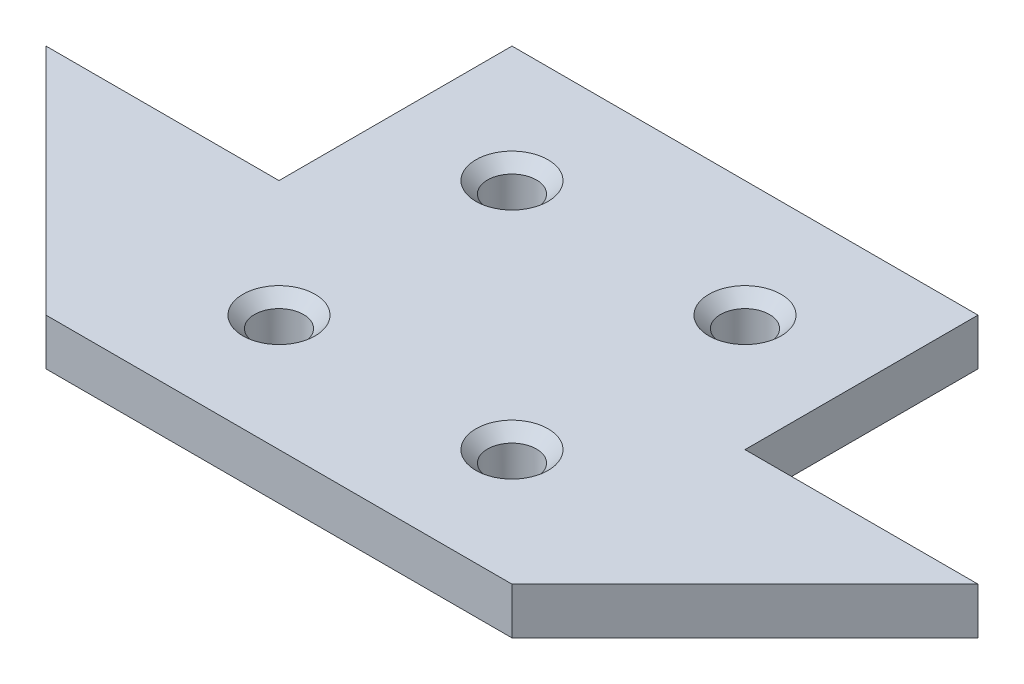
ISO-10303-21;
HEADER;
FILE_DESCRIPTION(('STEP AP214'),'2;1');
FILE_NAME('part.step','',(''),(''),'','','');
FILE_SCHEMA(('AUTOMOTIVE_DESIGN { 1 0 10303 214 1 1 1 1 }'));
ENDSEC;
DATA;
#1=APPLICATION_CONTEXT('core data for automotive mechanical design processes');
#2=APPLICATION_PROTOCOL_DEFINITION('international standard','automotive_design',2000,#1);
#3=PRODUCT_CONTEXT('',#1,'mechanical');
#4=PRODUCT('Part','Part','',(#3));
#5=PRODUCT_RELATED_PRODUCT_CATEGORY('part','',(#4));
#6=PRODUCT_DEFINITION_FORMATION('','',#4);
#7=PRODUCT_DEFINITION_CONTEXT('part definition',#1,'design');
#8=PRODUCT_DEFINITION('design','',#6,#7);
#9=PRODUCT_DEFINITION_SHAPE('','',#8);
#10=(LENGTH_UNIT() NAMED_UNIT(*) SI_UNIT(.MILLI.,.METRE.));
#11=(NAMED_UNIT(*) PLANE_ANGLE_UNIT() SI_UNIT($,.RADIAN.));
#12=(NAMED_UNIT(*) SI_UNIT($,.STERADIAN.) SOLID_ANGLE_UNIT());
#13=UNCERTAINTY_MEASURE_WITH_UNIT(LENGTH_MEASURE(1.E-05),#10,'distance_accuracy_value','');
#14=(GEOMETRIC_REPRESENTATION_CONTEXT(3) GLOBAL_UNCERTAINTY_ASSIGNED_CONTEXT((#13)) GLOBAL_UNIT_ASSIGNED_CONTEXT((#10,
#11,#12)) REPRESENTATION_CONTEXT('',''));
#15=CARTESIAN_POINT('',(0.,0.,0.));
#16=DIRECTION('',(0.,0.,1.));
#17=DIRECTION('',(1.,0.,0.));
#18=AXIS2_PLACEMENT_3D('',#15,#16,#17);
#19=CARTESIAN_POINT('',(-4.54004576659039,4.,-6.76430205949657));
#20=DIRECTION('',(1.,0.,0.));
#21=DIRECTION('',(0.,0.,-1.));
#22=AXIS2_PLACEMENT_3D('',#19,#20,#21);
#23=PLANE('',#22);
#24=DIRECTION('',(0.,0.,1.));
#25=VECTOR('',#24,1.);
#26=CARTESIAN_POINT('',(-4.54004576659039,0.,-6.76430205949657));
#27=LINE('',#26,#25);
#28=CARTESIAN_POINT('',(-4.54004576659039,0.,-6.76430205949657));
#29=VERTEX_POINT('',#28);
#30=CARTESIAN_POINT('',(-4.54004576659039,0.,13.2356979405034));
#31=VERTEX_POINT('',#30);
#32=EDGE_CURVE('E149',#29,#31,#27,.T.);
#33=ORIENTED_EDGE('',*,*,#32,.T.);
#34=DIRECTION('',(0.,-1.,0.));
#35=VECTOR('',#34,1.);
#36=CARTESIAN_POINT('',(-4.54004576659039,4.,13.2356979405034));
#37=LINE('',#36,#35);
#38=CARTESIAN_POINT('',(-4.54004576659039,4.,13.2356979405034));
#39=VERTEX_POINT('',#38);
#40=EDGE_CURVE('E194',#39,#31,#37,.T.);
#41=ORIENTED_EDGE('',*,*,#40,.F.);
#42=DIRECTION('',(0.,0.,1.));
#43=VECTOR('',#42,1.);
#44=CARTESIAN_POINT('',(-4.54004576659039,4.,-6.76430205949657));
#45=LINE('',#44,#43);
#46=CARTESIAN_POINT('',(-4.54004576659039,4.,-6.76430205949657));
#47=VERTEX_POINT('',#46);
#48=EDGE_CURVE('E176',#47,#39,#45,.T.);
#49=ORIENTED_EDGE('',*,*,#48,.F.);
#50=DIRECTION('',(0.,-1.,0.));
#51=VECTOR('',#50,1.);
#52=CARTESIAN_POINT('',(-4.54004576659039,4.,-6.76430205949657));
#53=LINE('',#52,#51);
#54=EDGE_CURVE('E64',#47,#29,#53,.T.);
#55=ORIENTED_EDGE('',*,*,#54,.T.);
#56=EDGE_LOOP('',(#33,#41,#49,#55));
#57=FACE_BOUND('',#56,.T.);
#58=ADVANCED_FACE('F45',(#57),#23,.F.);
#59=CARTESIAN_POINT('',(-4.54004576659039,4.,13.2356979405034));
#60=DIRECTION('',(0.,0.,1.));
#61=DIRECTION('',(1.,0.,0.));
#62=AXIS2_PLACEMENT_3D('',#59,#60,#61);
#63=PLANE('',#62);
#64=DIRECTION('',(-1.,0.,0.));
#65=VECTOR('',#64,1.);
#66=CARTESIAN_POINT('',(-4.54004576659039,0.,13.2356979405034));
#67=LINE('',#66,#65);
#68=CARTESIAN_POINT('',(-24.5400457665904,0.,13.2356979405034));
#69=VERTEX_POINT('',#68);
#70=EDGE_CURVE('E152',#31,#69,#67,.T.);
#71=ORIENTED_EDGE('',*,*,#70,.T.);
#72=DIRECTION('',(0.,-1.,0.));
#73=VECTOR('',#72,1.);
#74=CARTESIAN_POINT('',(-24.5400457665904,4.,13.2356979405034));
#75=LINE('',#74,#73);
#76=CARTESIAN_POINT('',(-24.5400457665904,4.,13.2356979405034));
#77=VERTEX_POINT('',#76);
#78=EDGE_CURVE('E190',#77,#69,#75,.T.);
#79=ORIENTED_EDGE('',*,*,#78,.F.);
#80=DIRECTION('',(-1.,0.,0.));
#81=VECTOR('',#80,1.);
#82=CARTESIAN_POINT('',(-4.54004576659039,4.,13.2356979405034));
#83=LINE('',#82,#81);
#84=EDGE_CURVE('E103',#39,#77,#83,.T.);
#85=ORIENTED_EDGE('',*,*,#84,.F.);
#86=ORIENTED_EDGE('',*,*,#40,.T.);
#87=EDGE_LOOP('',(#71,#79,#85,#86));
#88=FACE_BOUND('',#87,.T.);
#89=ADVANCED_FACE('F242',(#88),#63,.F.);
#90=CARTESIAN_POINT('',(-24.5400457665904,4.,13.2356979405034));
#91=DIRECTION('',(0.707106781186547,0.,-0.707106781186548));
#92=DIRECTION('',(-0.707106781186548,0.,-0.707106781186547));
#93=AXIS2_PLACEMENT_3D('',#90,#91,#92);
#94=PLANE('',#93);
#95=DIRECTION('',(0.707106781186548,0.,0.707106781186547));
#96=VECTOR('',#95,1.);
#97=CARTESIAN_POINT('',(-24.5400457665904,0.,13.2356979405034));
#98=LINE('',#97,#96);
#99=CARTESIAN_POINT('',(-4.54004576659039,0.,33.2356979405034));
#100=VERTEX_POINT('',#99);
#101=EDGE_CURVE('E156',#69,#100,#98,.T.);
#102=ORIENTED_EDGE('',*,*,#101,.T.);
#103=DIRECTION('',(0.,-1.,0.));
#104=VECTOR('',#103,1.);
#105=CARTESIAN_POINT('',(-4.54004576659039,4.,33.2356979405034));
#106=LINE('',#105,#104);
#107=CARTESIAN_POINT('',(-4.54004576659039,4.,33.2356979405034));
#108=VERTEX_POINT('',#107);
#109=EDGE_CURVE('E186',#108,#100,#106,.T.);
#110=ORIENTED_EDGE('',*,*,#109,.F.);
#111=DIRECTION('',(0.707106781186548,0.,0.707106781186547));
#112=VECTOR('',#111,1.);
#113=CARTESIAN_POINT('',(-24.5400457665904,4.,13.2356979405034));
#114=LINE('',#113,#112);
#115=EDGE_CURVE('E297',#77,#108,#114,.T.);
#116=ORIENTED_EDGE('',*,*,#115,.F.);
#117=ORIENTED_EDGE('',*,*,#78,.T.);
#118=EDGE_LOOP('',(#102,#110,#116,#117));
#119=FACE_BOUND('',#118,.T.);
#120=ADVANCED_FACE('F247',(#119),#94,.F.);
#121=CARTESIAN_POINT('',(-4.54004576659039,4.,33.2356979405034));
#122=DIRECTION('',(0.,0.,-1.));
#123=DIRECTION('',(-1.,0.,0.));
#124=AXIS2_PLACEMENT_3D('',#121,#122,#123);
#125=PLANE('',#124);
#126=DIRECTION('',(1.,0.,0.));
#127=VECTOR('',#126,1.);
#128=CARTESIAN_POINT('',(-4.54004576659039,0.,33.2356979405034));
#129=LINE('',#128,#127);
#130=CARTESIAN_POINT('',(35.4599542334096,0.,33.2356979405034));
#131=VERTEX_POINT('',#130);
#132=EDGE_CURVE('E159',#100,#131,#129,.T.);
#133=ORIENTED_EDGE('',*,*,#132,.T.);
#134=DIRECTION('',(0.,-1.,0.));
#135=VECTOR('',#134,1.);
#136=CARTESIAN_POINT('',(35.4599542334096,4.,33.2356979405034));
#137=LINE('',#136,#135);
#138=CARTESIAN_POINT('',(35.4599542334096,4.,33.2356979405034));
#139=VERTEX_POINT('',#138);
#140=EDGE_CURVE('E183',#139,#131,#137,.T.);
#141=ORIENTED_EDGE('',*,*,#140,.F.);
#142=DIRECTION('',(1.,0.,0.));
#143=VECTOR('',#142,1.);
#144=CARTESIAN_POINT('',(-4.54004576659039,4.,33.2356979405034));
#145=LINE('',#144,#143);
#146=EDGE_CURVE('E300',#108,#139,#145,.T.);
#147=ORIENTED_EDGE('',*,*,#146,.F.);
#148=ORIENTED_EDGE('',*,*,#109,.T.);
#149=EDGE_LOOP('',(#133,#141,#147,#148));
#150=FACE_BOUND('',#149,.T.);
#151=ADVANCED_FACE('F325',(#150),#125,.F.);
#152=CARTESIAN_POINT('',(55.4599542334096,4.,13.2356979405034));
#153=DIRECTION('',(0.707106781186547,0.,0.707106781186548));
#154=DIRECTION('',(0.707106781186548,0.,-0.707106781186547));
#155=AXIS2_PLACEMENT_3D('',#152,#153,#154);
#156=PLANE('',#155);
#157=DIRECTION('',(-0.707106781186548,0.,0.707106781186547));
#158=VECTOR('',#157,1.);
#159=CARTESIAN_POINT('',(55.4599542334096,0.,13.2356979405034));
#160=LINE('',#159,#158);
#161=CARTESIAN_POINT('',(55.4599542334096,0.,13.2356979405034));
#162=VERTEX_POINT('',#161);
#163=EDGE_CURVE('E163',#162,#131,#160,.T.);
#164=ORIENTED_EDGE('',*,*,#163,.F.);
#165=DIRECTION('',(0.,-1.,0.));
#166=VECTOR('',#165,1.);
#167=CARTESIAN_POINT('',(55.4599542334096,4.,13.2356979405034));
#168=LINE('',#167,#166);
#169=CARTESIAN_POINT('',(55.4599542334096,4.,13.2356979405034));
#170=VERTEX_POINT('',#169);
#171=EDGE_CURVE('E129',#170,#162,#168,.T.);
#172=ORIENTED_EDGE('',*,*,#171,.F.);
#173=DIRECTION('',(-0.707106781186548,0.,0.707106781186547));
#174=VECTOR('',#173,1.);
#175=CARTESIAN_POINT('',(55.4599542334096,4.,13.2356979405034));
#176=LINE('',#175,#174);
#177=EDGE_CURVE('E138',#170,#139,#176,.T.);
#178=ORIENTED_EDGE('',*,*,#177,.T.);
#179=ORIENTED_EDGE('',*,*,#140,.T.);
#180=EDGE_LOOP('',(#164,#172,#178,#179));
#181=FACE_BOUND('',#180,.T.);
#182=ADVANCED_FACE('F305',(#181),#156,.T.);
#183=CARTESIAN_POINT('',(35.4599542334096,4.,13.2356979405034));
#184=DIRECTION('',(0.,0.,-1.));
#185=DIRECTION('',(-1.,0.,0.));
#186=AXIS2_PLACEMENT_3D('',#183,#184,#185);
#187=PLANE('',#186);
#188=DIRECTION('',(1.,0.,0.));
#189=VECTOR('',#188,1.);
#190=CARTESIAN_POINT('',(35.4599542334096,0.,13.2356979405034));
#191=LINE('',#190,#189);
#192=CARTESIAN_POINT('',(35.4599542334096,0.,13.2356979405034));
#193=VERTEX_POINT('',#192);
#194=EDGE_CURVE('E124',#193,#162,#191,.T.);
#195=ORIENTED_EDGE('',*,*,#194,.F.);
#196=DIRECTION('',(0.,-1.,0.));
#197=VECTOR('',#196,1.);
#198=CARTESIAN_POINT('',(35.4599542334096,4.,13.2356979405034));
#199=LINE('',#198,#197);
#200=CARTESIAN_POINT('',(35.4599542334096,4.,13.2356979405034));
#201=VERTEX_POINT('',#200);
#202=EDGE_CURVE('E119',#201,#193,#199,.T.);
#203=ORIENTED_EDGE('',*,*,#202,.F.);
#204=DIRECTION('',(1.,0.,0.));
#205=VECTOR('',#204,1.);
#206=CARTESIAN_POINT('',(35.4599542334096,4.,13.2356979405034));
#207=LINE('',#206,#205);
#208=EDGE_CURVE('E122',#201,#170,#207,.T.);
#209=ORIENTED_EDGE('',*,*,#208,.T.);
#210=ORIENTED_EDGE('',*,*,#171,.T.);
#211=EDGE_LOOP('',(#195,#203,#209,#210));
#212=FACE_BOUND('',#211,.T.);
#213=ADVANCED_FACE('F121',(#212),#187,.T.);
#214=CARTESIAN_POINT('',(35.4599542334096,4.,-6.76430205949657));
#215=DIRECTION('',(1.,0.,0.));
#216=DIRECTION('',(0.,0.,-1.));
#217=AXIS2_PLACEMENT_3D('',#214,#215,#216);
#218=PLANE('',#217);
#219=DIRECTION('',(0.,0.,1.));
#220=VECTOR('',#219,1.);
#221=CARTESIAN_POINT('',(35.4599542334096,0.,-6.76430205949657));
#222=LINE('',#221,#220);
#223=CARTESIAN_POINT('',(35.4599542334096,0.,-6.76430205949657));
#224=VERTEX_POINT('',#223);
#225=EDGE_CURVE('E169',#224,#193,#222,.T.);
#226=ORIENTED_EDGE('',*,*,#225,.F.);
#227=DIRECTION('',(0.,-1.,0.));
#228=VECTOR('',#227,1.);
#229=CARTESIAN_POINT('',(35.4599542334096,4.,-6.76430205949657));
#230=LINE('',#229,#228);
#231=CARTESIAN_POINT('',(35.4599542334096,4.,-6.76430205949657));
#232=VERTEX_POINT('',#231);
#233=EDGE_CURVE('E90',#232,#224,#230,.T.);
#234=ORIENTED_EDGE('',*,*,#233,.F.);
#235=DIRECTION('',(0.,0.,1.));
#236=VECTOR('',#235,1.);
#237=CARTESIAN_POINT('',(35.4599542334096,4.,-6.76430205949657));
#238=LINE('',#237,#236);
#239=EDGE_CURVE('E136',#232,#201,#238,.T.);
#240=ORIENTED_EDGE('',*,*,#239,.T.);
#241=ORIENTED_EDGE('',*,*,#202,.T.);
#242=EDGE_LOOP('',(#226,#234,#240,#241));
#243=FACE_BOUND('',#242,.T.);
#244=ADVANCED_FACE('F141',(#243),#218,.T.);
#245=CARTESIAN_POINT('',(-4.54004576659039,4.,-6.76430205949657));
#246=DIRECTION('',(0.,0.,-1.));
#247=DIRECTION('',(-1.,0.,0.));
#248=AXIS2_PLACEMENT_3D('',#245,#246,#247);
#249=PLANE('',#248);
#250=DIRECTION('',(1.,0.,0.));
#251=VECTOR('',#250,1.);
#252=CARTESIAN_POINT('',(-4.54004576659039,0.,-6.76430205949657));
#253=LINE('',#252,#251);
#254=EDGE_CURVE('E172',#29,#224,#253,.T.);
#255=ORIENTED_EDGE('',*,*,#254,.F.);
#256=ORIENTED_EDGE('',*,*,#54,.F.);
#257=DIRECTION('',(1.,0.,0.));
#258=VECTOR('',#257,1.);
#259=CARTESIAN_POINT('',(-4.54004576659039,4.,-6.76430205949657));
#260=LINE('',#259,#258);
#261=EDGE_CURVE('E143',#47,#232,#260,.T.);
#262=ORIENTED_EDGE('',*,*,#261,.T.);
#263=ORIENTED_EDGE('',*,*,#233,.T.);
#264=EDGE_LOOP('',(#255,#256,#262,#263));
#265=FACE_BOUND('',#264,.T.);
#266=ADVANCED_FACE('F309',(#265),#249,.T.);
#267=CARTESIAN_POINT('',(0.,4.,0.));
#268=DIRECTION('',(0.,-1.,0.));
#269=DIRECTION('',(0.,0.,-1.));
#270=AXIS2_PLACEMENT_3D('',#267,#268,#269);
#271=PLANE('',#270);
#272=CARTESIAN_POINT('',(5.45995423340961,4.,23.2356979405034));
#273=DIRECTION('',(0.,-1.,0.));
#274=DIRECTION('',(0.,0.,-1.));
#275=AXIS2_PLACEMENT_3D('',#272,#273,#274);
#276=CIRCLE('',#275,3.10000000000001);
#277=CARTESIAN_POINT('',(5.45995423340961,4.,20.1356979405034));
#278=VERTEX_POINT('',#277);
#279=EDGE_CURVE('E213',#278,#278,#276,.T.);
#280=ORIENTED_EDGE('',*,*,#279,.T.);
#281=EDGE_LOOP('',(#280));
#282=FACE_BOUND('',#281,.T.);
#283=CARTESIAN_POINT('',(25.4599542334096,4.,23.2356979405034));
#284=DIRECTION('',(0.,-1.,0.));
#285=DIRECTION('',(0.,0.,-1.));
#286=AXIS2_PLACEMENT_3D('',#283,#284,#285);
#287=CIRCLE('',#286,3.10000000000001);
#288=CARTESIAN_POINT('',(25.4599542334096,4.,20.1356979405034));
#289=VERTEX_POINT('',#288);
#290=EDGE_CURVE('E209',#289,#289,#287,.T.);
#291=ORIENTED_EDGE('',*,*,#290,.T.);
#292=EDGE_LOOP('',(#291));
#293=FACE_BOUND('',#292,.T.);
#294=CARTESIAN_POINT('',(25.4599542334096,4.,3.23569794050344));
#295=DIRECTION('',(0.,-1.,0.));
#296=DIRECTION('',(0.,0.,-1.));
#297=AXIS2_PLACEMENT_3D('',#294,#295,#296);
#298=CIRCLE('',#297,3.10000000000001);
#299=CARTESIAN_POINT('',(25.4599542334096,4.,0.135697940503433));
#300=VERTEX_POINT('',#299);
#301=EDGE_CURVE('E205',#300,#300,#298,.T.);
#302=ORIENTED_EDGE('',*,*,#301,.T.);
#303=EDGE_LOOP('',(#302));
#304=FACE_BOUND('',#303,.T.);
#305=CARTESIAN_POINT('',(5.45995423340961,4.,3.23569794050343));
#306=DIRECTION('',(0.,-1.,0.));
#307=DIRECTION('',(0.,0.,-1.));
#308=AXIS2_PLACEMENT_3D('',#305,#306,#307);
#309=CIRCLE('',#308,3.10000000000001);
#310=CARTESIAN_POINT('',(5.45995423340961,4.,0.135697940503429));
#311=VERTEX_POINT('',#310);
#312=EDGE_CURVE('E201',#311,#311,#309,.T.);
#313=ORIENTED_EDGE('',*,*,#312,.T.);
#314=EDGE_LOOP('',(#313));
#315=FACE_BOUND('',#314,.T.);
#316=ORIENTED_EDGE('',*,*,#48,.T.);
#317=ORIENTED_EDGE('',*,*,#84,.T.);
#318=ORIENTED_EDGE('',*,*,#115,.T.);
#319=ORIENTED_EDGE('',*,*,#146,.T.);
#320=ORIENTED_EDGE('',*,*,#177,.F.);
#321=ORIENTED_EDGE('',*,*,#208,.F.);
#322=ORIENTED_EDGE('',*,*,#239,.F.);
#323=ORIENTED_EDGE('',*,*,#261,.F.);
#324=EDGE_LOOP('',(#316,#317,#318,#319,#320,#321,#322,#323));
#325=FACE_BOUND('',#324,.T.);
#326=ADVANCED_FACE('F134',(#282,#293,#304,#315,#325),#271,.F.);
#327=CARTESIAN_POINT('',(0.,0.,0.));
#328=DIRECTION('',(0.,-1.,0.));
#329=DIRECTION('',(0.,0.,-1.));
#330=AXIS2_PLACEMENT_3D('',#327,#328,#329);
#331=PLANE('',#330);
#332=CARTESIAN_POINT('',(5.45995423340961,0.,3.23569794050343));
#333=DIRECTION('',(0.,1.,0.));
#334=DIRECTION('',(0.,0.,-1.));
#335=AXIS2_PLACEMENT_3D('',#332,#333,#334);
#336=CIRCLE('',#335,2.1);
#337=CARTESIAN_POINT('',(5.45995423340961,0.,1.13569794050343));
#338=VERTEX_POINT('',#337);
#339=EDGE_CURVE('E291',#338,#338,#336,.T.);
#340=ORIENTED_EDGE('',*,*,#339,.T.);
#341=EDGE_LOOP('',(#340));
#342=FACE_BOUND('',#341,.T.);
#343=CARTESIAN_POINT('',(25.4599542334096,0.,3.23569794050344));
#344=DIRECTION('',(0.,1.,0.));
#345=DIRECTION('',(0.,0.,-1.));
#346=AXIS2_PLACEMENT_3D('',#343,#344,#345);
#347=CIRCLE('',#346,2.1);
#348=CARTESIAN_POINT('',(25.4599542334096,0.,1.13569794050344));
#349=VERTEX_POINT('',#348);
#350=EDGE_CURVE('E287',#349,#349,#347,.T.);
#351=ORIENTED_EDGE('',*,*,#350,.T.);
#352=EDGE_LOOP('',(#351));
#353=FACE_BOUND('',#352,.T.);
#354=CARTESIAN_POINT('',(25.4599542334096,0.,23.2356979405034));
#355=DIRECTION('',(0.,1.,0.));
#356=DIRECTION('',(0.,0.,1.));
#357=AXIS2_PLACEMENT_3D('',#354,#355,#356);
#358=CIRCLE('',#357,2.1);
#359=CARTESIAN_POINT('',(25.4599542334096,0.,25.3356979405034));
#360=VERTEX_POINT('',#359);
#361=EDGE_CURVE('E283',#360,#360,#358,.T.);
#362=ORIENTED_EDGE('',*,*,#361,.T.);
#363=EDGE_LOOP('',(#362));
#364=FACE_BOUND('',#363,.T.);
#365=CARTESIAN_POINT('',(5.45995423340961,0.,23.2356979405034));
#366=DIRECTION('',(0.,1.,0.));
#367=DIRECTION('',(0.,0.,1.));
#368=AXIS2_PLACEMENT_3D('',#365,#366,#367);
#369=CIRCLE('',#368,2.1);
#370=CARTESIAN_POINT('',(5.45995423340961,0.,25.3356979405034));
#371=VERTEX_POINT('',#370);
#372=EDGE_CURVE('E153',#371,#371,#369,.T.);
#373=ORIENTED_EDGE('',*,*,#372,.T.);
#374=EDGE_LOOP('',(#373));
#375=FACE_BOUND('',#374,.T.);
#376=ORIENTED_EDGE('',*,*,#32,.F.);
#377=ORIENTED_EDGE('',*,*,#254,.T.);
#378=ORIENTED_EDGE('',*,*,#225,.T.);
#379=ORIENTED_EDGE('',*,*,#194,.T.);
#380=ORIENTED_EDGE('',*,*,#163,.T.);
#381=ORIENTED_EDGE('',*,*,#132,.F.);
#382=ORIENTED_EDGE('',*,*,#101,.F.);
#383=ORIENTED_EDGE('',*,*,#70,.F.);
#384=EDGE_LOOP('',(#376,#377,#378,#379,#380,#381,#382,#383));
#385=FACE_BOUND('',#384,.T.);
#386=ADVANCED_FACE('F277',(#342,#353,#364,#375,#385),#331,.T.);
#387=CARTESIAN_POINT('',(5.45995423340961,0.,23.2356979405034));
#388=DIRECTION('',(0.,1.,0.));
#389=DIRECTION('',(0.,0.,1.));
#390=AXIS2_PLACEMENT_3D('',#387,#388,#389);
#391=CYLINDRICAL_SURFACE('',#390,2.1);
#392=CARTESIAN_POINT('',(5.45995423340961,3.,23.2356979405034));
#393=DIRECTION('',(0.,-1.,0.));
#394=DIRECTION('',(0.,0.,-1.));
#395=AXIS2_PLACEMENT_3D('',#392,#393,#394);
#396=CIRCLE('',#395,2.1);
#397=CARTESIAN_POINT('',(5.45995423340961,3.,21.1356979405034));
#398=VERTEX_POINT('',#397);
#399=EDGE_CURVE('E197',#398,#398,#396,.F.);
#400=ORIENTED_EDGE('',*,*,#399,.T.);
#401=EDGE_LOOP('',(#400));
#402=FACE_BOUND('',#401,.T.);
#403=ORIENTED_EDGE('',*,*,#372,.F.);
#404=EDGE_LOOP('',(#403));
#405=FACE_BOUND('',#404,.T.);
#406=ADVANCED_FACE('F273',(#402,#405),#391,.F.);
#407=CARTESIAN_POINT('',(25.4599542334096,0.,23.2356979405034));
#408=DIRECTION('',(0.,1.,0.));
#409=DIRECTION('',(0.,0.,1.));
#410=AXIS2_PLACEMENT_3D('',#407,#408,#409);
#411=CYLINDRICAL_SURFACE('',#410,2.1);
#412=CARTESIAN_POINT('',(25.4599542334096,3.,23.2356979405034));
#413=DIRECTION('',(0.,-1.,0.));
#414=DIRECTION('',(0.,0.,-1.));
#415=AXIS2_PLACEMENT_3D('',#412,#413,#414);
#416=CIRCLE('',#415,2.1);
#417=CARTESIAN_POINT('',(25.4599542334096,3.,21.1356979405034));
#418=VERTEX_POINT('',#417);
#419=EDGE_CURVE('E217',#418,#418,#416,.F.);
#420=ORIENTED_EDGE('',*,*,#419,.T.);
#421=EDGE_LOOP('',(#420));
#422=FACE_BOUND('',#421,.T.);
#423=ORIENTED_EDGE('',*,*,#361,.F.);
#424=EDGE_LOOP('',(#423));
#425=FACE_BOUND('',#424,.T.);
#426=ADVANCED_FACE('F276',(#422,#425),#411,.F.);
#427=CARTESIAN_POINT('',(25.4599542334096,0.,3.23569794050344));
#428=DIRECTION('',(0.,1.,0.));
#429=DIRECTION('',(0.,0.,1.));
#430=AXIS2_PLACEMENT_3D('',#427,#428,#429);
#431=CYLINDRICAL_SURFACE('',#430,2.1);
#432=CARTESIAN_POINT('',(25.4599542334096,3.,3.23569794050344));
#433=DIRECTION('',(0.,-1.,0.));
#434=DIRECTION('',(0.,0.,-1.));
#435=AXIS2_PLACEMENT_3D('',#432,#433,#434);
#436=CIRCLE('',#435,2.1);
#437=CARTESIAN_POINT('',(25.4599542334096,3.,1.13569794050344));
#438=VERTEX_POINT('',#437);
#439=EDGE_CURVE('E56',#438,#438,#436,.F.);
#440=ORIENTED_EDGE('',*,*,#439,.T.);
#441=EDGE_LOOP('',(#440));
#442=FACE_BOUND('',#441,.T.);
#443=ORIENTED_EDGE('',*,*,#350,.F.);
#444=EDGE_LOOP('',(#443));
#445=FACE_BOUND('',#444,.T.);
#446=ADVANCED_FACE('F224',(#442,#445),#431,.F.);
#447=CARTESIAN_POINT('',(5.45995423340961,0.,3.23569794050343));
#448=DIRECTION('',(0.,1.,0.));
#449=DIRECTION('',(0.,0.,1.));
#450=AXIS2_PLACEMENT_3D('',#447,#448,#449);
#451=CYLINDRICAL_SURFACE('',#450,2.1);
#452=CARTESIAN_POINT('',(5.45995423340961,3.,3.23569794050343));
#453=DIRECTION('',(0.,-1.,0.));
#454=DIRECTION('',(0.,0.,-1.));
#455=AXIS2_PLACEMENT_3D('',#452,#453,#454);
#456=CIRCLE('',#455,2.1);
#457=CARTESIAN_POINT('',(5.45995423340961,3.,1.13569794050343));
#458=VERTEX_POINT('',#457);
#459=EDGE_CURVE('E11',#458,#458,#456,.F.);
#460=ORIENTED_EDGE('',*,*,#459,.T.);
#461=EDGE_LOOP('',(#460));
#462=FACE_BOUND('',#461,.T.);
#463=ORIENTED_EDGE('',*,*,#339,.F.);
#464=EDGE_LOOP('',(#463));
#465=FACE_BOUND('',#464,.T.);
#466=ADVANCED_FACE('F256',(#462,#465),#451,.F.);
#467=CARTESIAN_POINT('',(5.45995423340961,3.,23.2356979405034));
#468=DIRECTION('',(0.,1.,0.));
#469=DIRECTION('',(0.,0.,1.));
#470=AXIS2_PLACEMENT_3D('',#467,#468,#469);
#471=CONICAL_SURFACE('',#470,2.1,0.785398163397452);
#472=ORIENTED_EDGE('',*,*,#279,.F.);
#473=EDGE_LOOP('',(#472));
#474=FACE_BOUND('',#473,.T.);
#475=ORIENTED_EDGE('',*,*,#399,.F.);
#476=EDGE_LOOP('',(#475));
#477=FACE_BOUND('',#476,.T.);
#478=ADVANCED_FACE('F236',(#474,#477),#471,.F.);
#479=CARTESIAN_POINT('',(25.4599542334096,3.,23.2356979405034));
#480=DIRECTION('',(0.,1.,0.));
#481=DIRECTION('',(0.,0.,1.));
#482=AXIS2_PLACEMENT_3D('',#479,#480,#481);
#483=CONICAL_SURFACE('',#482,2.1,0.785398163397451);
#484=ORIENTED_EDGE('',*,*,#290,.F.);
#485=EDGE_LOOP('',(#484));
#486=FACE_BOUND('',#485,.T.);
#487=ORIENTED_EDGE('',*,*,#419,.F.);
#488=EDGE_LOOP('',(#487));
#489=FACE_BOUND('',#488,.T.);
#490=ADVANCED_FACE('F229',(#486,#489),#483,.F.);
#491=CARTESIAN_POINT('',(25.4599542334096,3.,3.23569794050344));
#492=DIRECTION('',(0.,1.,0.));
#493=DIRECTION('',(0.,0.,1.));
#494=AXIS2_PLACEMENT_3D('',#491,#492,#493);
#495=CONICAL_SURFACE('',#494,2.1,0.785398163397452);
#496=ORIENTED_EDGE('',*,*,#301,.F.);
#497=EDGE_LOOP('',(#496));
#498=FACE_BOUND('',#497,.T.);
#499=ORIENTED_EDGE('',*,*,#439,.F.);
#500=EDGE_LOOP('',(#499));
#501=FACE_BOUND('',#500,.T.);
#502=ADVANCED_FACE('F227',(#498,#501),#495,.F.);
#503=CARTESIAN_POINT('',(5.45995423340961,3.,3.23569794050343));
#504=DIRECTION('',(0.,1.,0.));
#505=DIRECTION('',(0.,0.,1.));
#506=AXIS2_PLACEMENT_3D('',#503,#504,#505);
#507=CONICAL_SURFACE('',#506,2.1,0.785398163397451);
#508=ORIENTED_EDGE('',*,*,#312,.F.);
#509=EDGE_LOOP('',(#508));
#510=FACE_BOUND('',#509,.T.);
#511=ORIENTED_EDGE('',*,*,#459,.F.);
#512=EDGE_LOOP('',(#511));
#513=FACE_BOUND('',#512,.T.);
#514=ADVANCED_FACE('F48',(#510,#513),#507,.F.);
#515=CLOSED_SHELL('',(#58,#89,#120,#151,#182,#213,#244,#266,#326,#386,#406,#426,#446,#466,#478,
#490,#502,#514));
#516=MANIFOLD_SOLID_BREP('B2',#515);
#517=ADVANCED_BREP_SHAPE_REPRESENTATION('',(#18,#516),#14);
#518=SHAPE_DEFINITION_REPRESENTATION(#9,#517);
ENDSEC;
END-ISO-10303-21;
